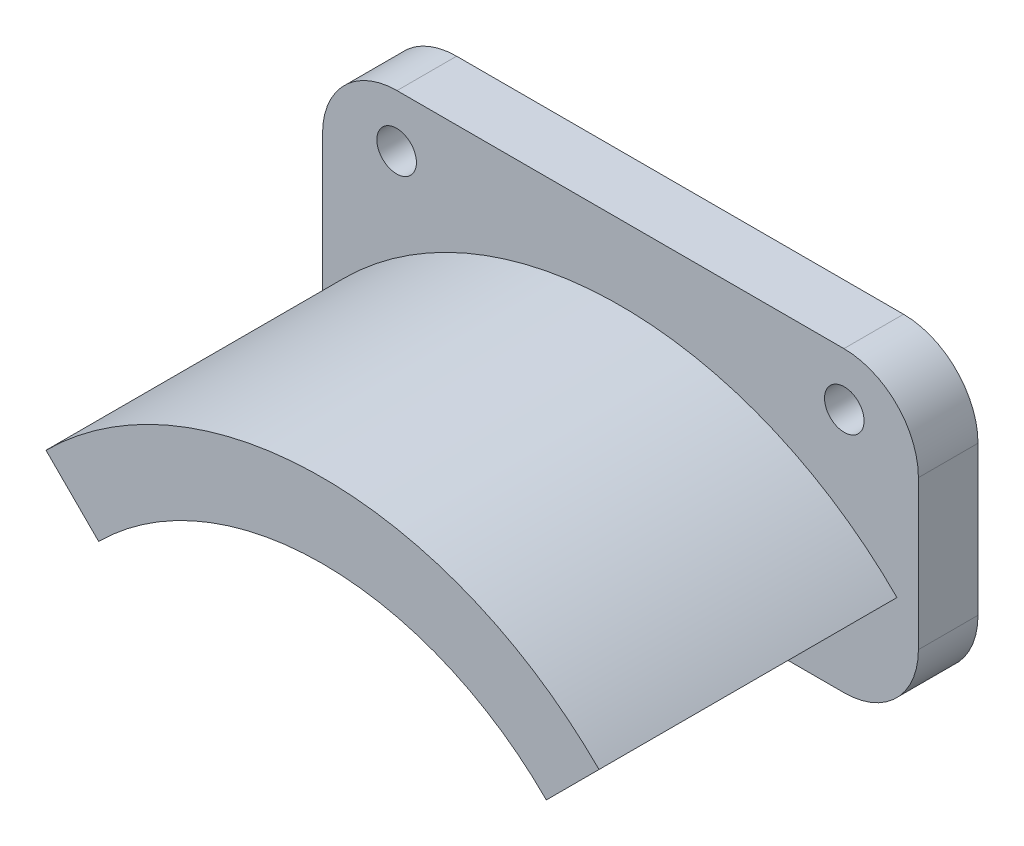
ISO-10303-21;
HEADER;
FILE_DESCRIPTION(('STEP AP214'),'2;1');
FILE_NAME('part.step','',(''),(''),'','','');
FILE_SCHEMA(('AUTOMOTIVE_DESIGN { 1 0 10303 214 1 1 1 1 }'));
ENDSEC;
DATA;
#1=APPLICATION_CONTEXT('core data for automotive mechanical design processes');
#2=APPLICATION_PROTOCOL_DEFINITION('international standard','automotive_design',2000,#1);
#3=PRODUCT_CONTEXT('',#1,'mechanical');
#4=PRODUCT('Part','Part','',(#3));
#5=PRODUCT_RELATED_PRODUCT_CATEGORY('part','',(#4));
#6=PRODUCT_DEFINITION_FORMATION('','',#4);
#7=PRODUCT_DEFINITION_CONTEXT('part definition',#1,'design');
#8=PRODUCT_DEFINITION('design','',#6,#7);
#9=PRODUCT_DEFINITION_SHAPE('','',#8);
#10=(LENGTH_UNIT() NAMED_UNIT(*) SI_UNIT(.MILLI.,.METRE.));
#11=(NAMED_UNIT(*) PLANE_ANGLE_UNIT() SI_UNIT($,.RADIAN.));
#12=(NAMED_UNIT(*) SI_UNIT($,.STERADIAN.) SOLID_ANGLE_UNIT());
#13=UNCERTAINTY_MEASURE_WITH_UNIT(LENGTH_MEASURE(1.E-05),#10,'distance_accuracy_value','');
#14=(GEOMETRIC_REPRESENTATION_CONTEXT(3) GLOBAL_UNCERTAINTY_ASSIGNED_CONTEXT((#13)) GLOBAL_UNIT_ASSIGNED_CONTEXT((#10,
#11,#12)) REPRESENTATION_CONTEXT('',''));
#15=CARTESIAN_POINT('',(0.,0.,0.));
#16=DIRECTION('',(0.,0.,1.));
#17=DIRECTION('',(1.,0.,0.));
#18=AXIS2_PLACEMENT_3D('',#15,#16,#17);
#19=CARTESIAN_POINT('',(0.,-21.25,-4.));
#20=DIRECTION('',(0.,0.,1.));
#21=DIRECTION('',(1.,0.,0.));
#22=AXIS2_PLACEMENT_3D('',#19,#20,#21);
#23=CYLINDRICAL_SURFACE('',#22,26.25);
#24=CARTESIAN_POINT('',(0.,-21.25,0.));
#25=DIRECTION('',(0.,0.,1.));
#26=DIRECTION('',(1.,0.,0.));
#27=AXIS2_PLACEMENT_3D('',#24,#25,#26);
#28=CIRCLE('',#27,26.25);
#29=CARTESIAN_POINT('',(18.5615530061468,-2.68844699385303,0.));
#30=VERTEX_POINT('',#29);
#31=CARTESIAN_POINT('',(-18.5615530061468,-2.68844699385304,0.));
#32=VERTEX_POINT('',#31);
#33=EDGE_CURVE('E190',#30,#32,#28,.T.);
#34=ORIENTED_EDGE('',*,*,#33,.T.);
#35=DIRECTION('',(0.,0.,1.));
#36=VECTOR('',#35,1.);
#37=CARTESIAN_POINT('',(-18.5615530061468,-2.68844699385304,-4.));
#38=LINE('',#37,#36);
#39=CARTESIAN_POINT('',(-18.5615530061468,-2.68844699385304,-4.));
#40=VERTEX_POINT('',#39);
#41=EDGE_CURVE('E165',#40,#32,#38,.T.);
#42=ORIENTED_EDGE('',*,*,#41,.F.);
#43=CARTESIAN_POINT('',(0.,-21.25,-4.));
#44=DIRECTION('',(0.,0.,1.));
#45=DIRECTION('',(1.,0.,0.));
#46=AXIS2_PLACEMENT_3D('',#43,#44,#45);
#47=CIRCLE('',#46,26.25);
#48=CARTESIAN_POINT('',(18.5615530061468,-2.68844699385303,-4.));
#49=VERTEX_POINT('',#48);
#50=EDGE_CURVE('E163',#49,#40,#47,.T.);
#51=ORIENTED_EDGE('',*,*,#50,.F.);
#52=DIRECTION('',(0.,0.,1.));
#53=VECTOR('',#52,1.);
#54=CARTESIAN_POINT('',(18.5615530061468,-2.68844699385303,-4.));
#55=LINE('',#54,#53);
#56=EDGE_CURVE('E148',#49,#30,#55,.T.);
#57=ORIENTED_EDGE('',*,*,#56,.T.);
#58=EDGE_LOOP('',(#34,#42,#51,#57));
#59=FACE_BOUND('',#58,.T.);
#60=ADVANCED_FACE('F55',(#59),#23,.F.);
#61=CARTESIAN_POINT('',(-10.625,-10.6249999999999,-4.));
#62=DIRECTION('',(-0.707106781186551,-0.707106781186544,0.));
#63=DIRECTION('',(0.707106781186544,-0.707106781186551,0.));
#64=AXIS2_PLACEMENT_3D('',#61,#62,#63);
#65=PLANE('',#64);
#66=DIRECTION('',(0.707106781186544,-0.707106781186551,0.));
#67=VECTOR('',#66,1.);
#68=CARTESIAN_POINT('',(-10.625,-10.6249999999999,0.));
#69=LINE('',#68,#67);
#70=CARTESIAN_POINT('',(-15.0260191002141,-6.22398089978579,0.));
#71=VERTEX_POINT('',#70);
#72=EDGE_CURVE('E196',#32,#71,#69,.T.);
#73=ORIENTED_EDGE('',*,*,#72,.T.);
#74=DIRECTION('',(0.,0.,1.));
#75=VECTOR('',#74,1.);
#76=CARTESIAN_POINT('',(-15.0260191002141,-6.22398089978579,-4.));
#77=LINE('',#76,#75);
#78=CARTESIAN_POINT('',(-15.0260191002141,-6.22398089978579,-4.));
#79=VERTEX_POINT('',#78);
#80=EDGE_CURVE('E202',#79,#71,#77,.T.);
#81=ORIENTED_EDGE('',*,*,#80,.F.);
#82=DIRECTION('',(0.707106781186544,-0.707106781186551,0.));
#83=VECTOR('',#82,1.);
#84=CARTESIAN_POINT('',(-10.625,-10.6249999999999,-4.));
#85=LINE('',#84,#83);
#86=EDGE_CURVE('E159',#40,#79,#85,.T.);
#87=ORIENTED_EDGE('',*,*,#86,.F.);
#88=ORIENTED_EDGE('',*,*,#41,.T.);
#89=EDGE_LOOP('',(#73,#81,#87,#88));
#90=FACE_BOUND('',#89,.T.);
#91=ADVANCED_FACE('F260',(#90),#65,.F.);
#92=CARTESIAN_POINT('',(0.,-21.25,-4.));
#93=DIRECTION('',(0.,0.,1.));
#94=DIRECTION('',(1.,0.,0.));
#95=AXIS2_PLACEMENT_3D('',#92,#93,#94);
#96=CYLINDRICAL_SURFACE('',#95,21.25);
#97=CARTESIAN_POINT('',(0.,-21.25,0.));
#98=DIRECTION('',(0.,0.,1.));
#99=DIRECTION('',(1.,0.,0.));
#100=AXIS2_PLACEMENT_3D('',#97,#98,#99);
#101=CIRCLE('',#100,21.25);
#102=CARTESIAN_POINT('',(15.0260191002141,-6.22398089978579,0.));
#103=VERTEX_POINT('',#102);
#104=EDGE_CURVE('E193',#103,#71,#101,.T.);
#105=ORIENTED_EDGE('',*,*,#104,.F.);
#106=DIRECTION('',(0.,0.,1.));
#107=VECTOR('',#106,1.);
#108=CARTESIAN_POINT('',(15.0260191002141,-6.22398089978579,-4.));
#109=LINE('',#108,#107);
#110=CARTESIAN_POINT('',(15.0260191002141,-6.22398089978579,-4.));
#111=VERTEX_POINT('',#110);
#112=EDGE_CURVE('E158',#111,#103,#109,.T.);
#113=ORIENTED_EDGE('',*,*,#112,.F.);
#114=CARTESIAN_POINT('',(0.,-21.25,-4.));
#115=DIRECTION('',(0.,0.,1.));
#116=DIRECTION('',(1.,0.,0.));
#117=AXIS2_PLACEMENT_3D('',#114,#115,#116);
#118=CIRCLE('',#117,21.25);
#119=EDGE_CURVE('E172',#111,#79,#118,.T.);
#120=ORIENTED_EDGE('',*,*,#119,.T.);
#121=ORIENTED_EDGE('',*,*,#80,.T.);
#122=EDGE_LOOP('',(#105,#113,#120,#121));
#123=FACE_BOUND('',#122,.T.);
#124=ADVANCED_FACE('F262',(#123),#96,.T.);
#125=CARTESIAN_POINT('',(-20.,0.,-4.));
#126=DIRECTION('',(-1.,0.,0.));
#127=DIRECTION('',(0.,0.,1.));
#128=AXIS2_PLACEMENT_3D('',#125,#126,#127);
#129=PLANE('',#128);
#130=DIRECTION('',(0.,-1.,0.));
#131=VECTOR('',#130,1.);
#132=CARTESIAN_POINT('',(-20.,0.,-4.));
#133=LINE('',#132,#131);
#134=CARTESIAN_POINT('',(-20.,4.99999999999999,-4.));
#135=VERTEX_POINT('',#134);
#136=CARTESIAN_POINT('',(-20.,-5.00000000000001,-4.));
#137=VERTEX_POINT('',#136);
#138=EDGE_CURVE('E199',#135,#137,#133,.T.);
#139=ORIENTED_EDGE('',*,*,#138,.T.);
#140=DIRECTION('',(0.,0.,1.));
#141=VECTOR('',#140,1.);
#142=CARTESIAN_POINT('',(-20.,-5.00000000000001,-4.));
#143=LINE('',#142,#141);
#144=CARTESIAN_POINT('',(-20.,-5.00000000000001,0.));
#145=VERTEX_POINT('',#144);
#146=EDGE_CURVE('E12',#137,#145,#143,.T.);
#147=ORIENTED_EDGE('',*,*,#146,.T.);
#148=DIRECTION('',(0.,-1.,0.));
#149=VECTOR('',#148,1.);
#150=CARTESIAN_POINT('',(-20.,0.,0.));
#151=LINE('',#150,#149);
#152=CARTESIAN_POINT('',(-20.,4.99999999999999,0.));
#153=VERTEX_POINT('',#152);
#154=EDGE_CURVE('E178',#153,#145,#151,.T.);
#155=ORIENTED_EDGE('',*,*,#154,.F.);
#156=DIRECTION('',(0.,0.,1.));
#157=VECTOR('',#156,1.);
#158=CARTESIAN_POINT('',(-20.,4.99999999999999,-4.));
#159=LINE('',#158,#157);
#160=EDGE_CURVE('E64',#153,#135,#159,.F.);
#161=ORIENTED_EDGE('',*,*,#160,.T.);
#162=EDGE_LOOP('',(#139,#147,#155,#161));
#163=FACE_BOUND('',#162,.T.);
#164=ADVANCED_FACE('F264',(#163),#129,.T.);
#165=CARTESIAN_POINT('',(0.,9.99999999999999,-4.));
#166=DIRECTION('',(0.,-1.,0.));
#167=DIRECTION('',(1.,0.,0.));
#168=AXIS2_PLACEMENT_3D('',#165,#166,#167);
#169=PLANE('',#168);
#170=DIRECTION('',(1.,0.,0.));
#171=VECTOR('',#170,1.);
#172=CARTESIAN_POINT('',(0.,9.99999999999999,0.));
#173=LINE('',#172,#171);
#174=CARTESIAN_POINT('',(-15.,9.99999999999999,0.));
#175=VERTEX_POINT('',#174);
#176=CARTESIAN_POINT('',(15.,9.99999999999999,0.));
#177=VERTEX_POINT('',#176);
#178=EDGE_CURVE('E187',#175,#177,#173,.T.);
#179=ORIENTED_EDGE('',*,*,#178,.T.);
#180=DIRECTION('',(0.,0.,1.));
#181=VECTOR('',#180,1.);
#182=CARTESIAN_POINT('',(15.,9.99999999999999,-4.));
#183=LINE('',#182,#181);
#184=CARTESIAN_POINT('',(15.,9.99999999999999,-4.));
#185=VERTEX_POINT('',#184);
#186=EDGE_CURVE('E220',#177,#185,#183,.F.);
#187=ORIENTED_EDGE('',*,*,#186,.T.);
#188=DIRECTION('',(1.,0.,0.));
#189=VECTOR('',#188,1.);
#190=CARTESIAN_POINT('',(0.,9.99999999999999,-4.));
#191=LINE('',#190,#189);
#192=CARTESIAN_POINT('',(-15.,9.99999999999999,-4.));
#193=VERTEX_POINT('',#192);
#194=EDGE_CURVE('E167',#193,#185,#191,.T.);
#195=ORIENTED_EDGE('',*,*,#194,.F.);
#196=DIRECTION('',(0.,0.,1.));
#197=VECTOR('',#196,1.);
#198=CARTESIAN_POINT('',(-15.,9.99999999999999,0.));
#199=LINE('',#198,#197);
#200=EDGE_CURVE('E217',#193,#175,#199,.T.);
#201=ORIENTED_EDGE('',*,*,#200,.T.);
#202=EDGE_LOOP('',(#179,#187,#195,#201));
#203=FACE_BOUND('',#202,.T.);
#204=ADVANCED_FACE('F271',(#203),#169,.F.);
#205=CARTESIAN_POINT('',(20.,0.,-4.));
#206=DIRECTION('',(-1.,0.,0.));
#207=DIRECTION('',(0.,-1.,0.));
#208=AXIS2_PLACEMENT_3D('',#205,#206,#207);
#209=PLANE('',#208);
#210=DIRECTION('',(0.,-1.,0.));
#211=VECTOR('',#210,1.);
#212=CARTESIAN_POINT('',(20.,0.,-4.));
#213=LINE('',#212,#211);
#214=CARTESIAN_POINT('',(20.,4.99999999999999,-4.));
#215=VERTEX_POINT('',#214);
#216=CARTESIAN_POINT('',(20.,-5.,-4.));
#217=VERTEX_POINT('',#216);
#218=EDGE_CURVE('E315',#215,#217,#213,.T.);
#219=ORIENTED_EDGE('',*,*,#218,.F.);
#220=DIRECTION('',(0.,0.,1.));
#221=VECTOR('',#220,1.);
#222=CARTESIAN_POINT('',(20.,4.99999999999999,-4.));
#223=LINE('',#222,#221);
#224=CARTESIAN_POINT('',(20.,4.99999999999999,0.));
#225=VERTEX_POINT('',#224);
#226=EDGE_CURVE('E206',#215,#225,#223,.T.);
#227=ORIENTED_EDGE('',*,*,#226,.T.);
#228=DIRECTION('',(0.,-1.,0.));
#229=VECTOR('',#228,1.);
#230=CARTESIAN_POINT('',(20.,0.,0.));
#231=LINE('',#230,#229);
#232=CARTESIAN_POINT('',(20.,-5.,0.));
#233=VERTEX_POINT('',#232);
#234=EDGE_CURVE('E184',#225,#233,#231,.T.);
#235=ORIENTED_EDGE('',*,*,#234,.T.);
#236=DIRECTION('',(0.,0.,1.));
#237=VECTOR('',#236,1.);
#238=CARTESIAN_POINT('',(20.,-5.,-4.));
#239=LINE('',#238,#237);
#240=EDGE_CURVE('E201',#233,#217,#239,.F.);
#241=ORIENTED_EDGE('',*,*,#240,.T.);
#242=EDGE_LOOP('',(#219,#227,#235,#241));
#243=FACE_BOUND('',#242,.T.);
#244=ADVANCED_FACE('F283',(#243),#209,.F.);
#245=CARTESIAN_POINT('',(0.,-10.,-4.));
#246=DIRECTION('',(0.,-1.,0.));
#247=DIRECTION('',(0.,0.,-1.));
#248=AXIS2_PLACEMENT_3D('',#245,#246,#247);
#249=PLANE('',#248);
#250=DIRECTION('',(1.,0.,0.));
#251=VECTOR('',#250,1.);
#252=CARTESIAN_POINT('',(0.,-10.,-4.));
#253=LINE('',#252,#251);
#254=CARTESIAN_POINT('',(-15.,-10.,-4.));
#255=VERTEX_POINT('',#254);
#256=CARTESIAN_POINT('',(15.,-10.,-4.));
#257=VERTEX_POINT('',#256);
#258=EDGE_CURVE('E311',#255,#257,#253,.T.);
#259=ORIENTED_EDGE('',*,*,#258,.T.);
#260=DIRECTION('',(0.,0.,1.));
#261=VECTOR('',#260,1.);
#262=CARTESIAN_POINT('',(15.,-10.,0.));
#263=LINE('',#262,#261);
#264=CARTESIAN_POINT('',(15.,-10.,0.));
#265=VERTEX_POINT('',#264);
#266=EDGE_CURVE('E230',#257,#265,#263,.T.);
#267=ORIENTED_EDGE('',*,*,#266,.T.);
#268=DIRECTION('',(1.,0.,0.));
#269=VECTOR('',#268,1.);
#270=CARTESIAN_POINT('',(0.,-10.,0.));
#271=LINE('',#270,#269);
#272=CARTESIAN_POINT('',(-15.,-10.,0.));
#273=VERTEX_POINT('',#272);
#274=EDGE_CURVE('E181',#273,#265,#271,.T.);
#275=ORIENTED_EDGE('',*,*,#274,.F.);
#276=DIRECTION('',(0.,0.,1.));
#277=VECTOR('',#276,1.);
#278=CARTESIAN_POINT('',(-15.,-10.,-4.));
#279=LINE('',#278,#277);
#280=EDGE_CURVE('E79',#273,#255,#279,.F.);
#281=ORIENTED_EDGE('',*,*,#280,.T.);
#282=EDGE_LOOP('',(#259,#267,#275,#281));
#283=FACE_BOUND('',#282,.T.);
#284=ADVANCED_FACE('F287',(#283),#249,.T.);
#285=CARTESIAN_POINT('',(10.625,-10.6249999999999,-4.));
#286=DIRECTION('',(-0.707106781186552,0.707106781186543,0.));
#287=DIRECTION('',(-0.707106781186543,-0.707106781186552,0.));
#288=AXIS2_PLACEMENT_3D('',#285,#286,#287);
#289=PLANE('',#288);
#290=DIRECTION('',(-0.707106781186543,-0.707106781186552,0.));
#291=VECTOR('',#290,1.);
#292=CARTESIAN_POINT('',(10.625,-10.6249999999999,0.));
#293=LINE('',#292,#291);
#294=EDGE_CURVE('E154',#30,#103,#293,.T.);
#295=ORIENTED_EDGE('',*,*,#294,.F.);
#296=ORIENTED_EDGE('',*,*,#56,.F.);
#297=DIRECTION('',(-0.707106781186543,-0.707106781186552,0.));
#298=VECTOR('',#297,1.);
#299=CARTESIAN_POINT('',(10.625,-10.6249999999999,-4.));
#300=LINE('',#299,#298);
#301=EDGE_CURVE('E152',#49,#111,#300,.T.);
#302=ORIENTED_EDGE('',*,*,#301,.T.);
#303=ORIENTED_EDGE('',*,*,#112,.T.);
#304=EDGE_LOOP('',(#295,#296,#302,#303));
#305=FACE_BOUND('',#304,.T.);
#306=ADVANCED_FACE('F150',(#305),#289,.T.);
#307=CARTESIAN_POINT('',(0.,0.,-4.));
#308=DIRECTION('',(0.,0.,1.));
#309=DIRECTION('',(1.,0.,0.));
#310=AXIS2_PLACEMENT_3D('',#307,#308,#309);
#311=PLANE('',#310);
#312=CARTESIAN_POINT('',(15.0246234134034,6.46885921792367,-4.));
#313=DIRECTION('',(0.,0.,1.));
#314=DIRECTION('',(1.,0.,0.));
#315=AXIS2_PLACEMENT_3D('',#312,#313,#314);
#316=CIRCLE('',#315,1.32715731225997);
#317=CARTESIAN_POINT('',(16.3517807256634,6.46885921792367,-4.));
#318=VERTEX_POINT('',#317);
#319=EDGE_CURVE('E237',#318,#318,#316,.T.);
#320=ORIENTED_EDGE('',*,*,#319,.T.);
#321=EDGE_LOOP('',(#320));
#322=FACE_BOUND('',#321,.T.);
#323=CARTESIAN_POINT('',(0.,-6.03114078207633,-4.));
#324=DIRECTION('',(0.,0.,1.));
#325=DIRECTION('',(1.,0.,0.));
#326=AXIS2_PLACEMENT_3D('',#323,#324,#325);
#327=CIRCLE('',#326,1.25);
#328=CARTESIAN_POINT('',(1.25,-6.03114078207633,-4.));
#329=VERTEX_POINT('',#328);
#330=EDGE_CURVE('E331',#329,#329,#327,.T.);
#331=ORIENTED_EDGE('',*,*,#330,.T.);
#332=EDGE_LOOP('',(#331));
#333=FACE_BOUND('',#332,.T.);
#334=CARTESIAN_POINT('',(-15.0246234134034,6.46885921792366,-4.));
#335=DIRECTION('',(0.,0.,1.));
#336=DIRECTION('',(-1.,0.,0.));
#337=AXIS2_PLACEMENT_3D('',#334,#335,#336);
#338=CIRCLE('',#337,1.32715731225997);
#339=CARTESIAN_POINT('',(-16.3517807256634,6.46885921792366,-4.));
#340=VERTEX_POINT('',#339);
#341=EDGE_CURVE('E318',#340,#340,#338,.T.);
#342=ORIENTED_EDGE('',*,*,#341,.T.);
#343=EDGE_LOOP('',(#342));
#344=FACE_BOUND('',#343,.T.);
#345=ORIENTED_EDGE('',*,*,#194,.T.);
#346=CARTESIAN_POINT('',(15.,4.99999999999999,-4.));
#347=DIRECTION('',(0.,0.,1.));
#348=DIRECTION('',(1.,0.,0.));
#349=AXIS2_PLACEMENT_3D('',#346,#347,#348);
#350=CIRCLE('',#349,5.);
#351=EDGE_CURVE('E227',#185,#215,#350,.F.);
#352=ORIENTED_EDGE('',*,*,#351,.T.);
#353=ORIENTED_EDGE('',*,*,#218,.T.);
#354=CARTESIAN_POINT('',(15.,-5.00000000000001,-4.));
#355=DIRECTION('',(0.,0.,1.));
#356=DIRECTION('',(1.,0.,0.));
#357=AXIS2_PLACEMENT_3D('',#354,#355,#356);
#358=CIRCLE('',#357,5.);
#359=EDGE_CURVE('E72',#217,#257,#358,.F.);
#360=ORIENTED_EDGE('',*,*,#359,.T.);
#361=ORIENTED_EDGE('',*,*,#258,.F.);
#362=CARTESIAN_POINT('',(-15.,-5.00000000000001,-4.));
#363=DIRECTION('',(0.,0.,1.));
#364=DIRECTION('',(1.,0.,0.));
#365=AXIS2_PLACEMENT_3D('',#362,#363,#364);
#366=CIRCLE('',#365,5.);
#367=EDGE_CURVE('E224',#255,#137,#366,.F.);
#368=ORIENTED_EDGE('',*,*,#367,.T.);
#369=ORIENTED_EDGE('',*,*,#138,.F.);
#370=CARTESIAN_POINT('',(-15.,4.99999999999999,-4.));
#371=DIRECTION('',(0.,0.,1.));
#372=DIRECTION('',(1.,0.,0.));
#373=AXIS2_PLACEMENT_3D('',#370,#371,#372);
#374=CIRCLE('',#373,5.);
#375=EDGE_CURVE('E222',#135,#193,#374,.F.);
#376=ORIENTED_EDGE('',*,*,#375,.T.);
#377=EDGE_LOOP('',(#345,#352,#353,#360,#361,#368,#369,#376));
#378=FACE_BOUND('',#377,.T.);
#379=ORIENTED_EDGE('',*,*,#50,.T.);
#380=ORIENTED_EDGE('',*,*,#86,.T.);
#381=ORIENTED_EDGE('',*,*,#119,.F.);
#382=ORIENTED_EDGE('',*,*,#301,.F.);
#383=EDGE_LOOP('',(#379,#380,#381,#382));
#384=FACE_BOUND('',#383,.T.);
#385=ADVANCED_FACE('F170',(#322,#333,#344,#378,#384),#311,.F.);
#386=CARTESIAN_POINT('',(0.,0.,0.));
#387=DIRECTION('',(0.,0.,1.));
#388=DIRECTION('',(1.,0.,0.));
#389=AXIS2_PLACEMENT_3D('',#386,#387,#388);
#390=PLANE('',#389);
#391=CARTESIAN_POINT('',(15.0246234134034,6.46885921792367,0.));
#392=DIRECTION('',(0.,0.,1.));
#393=DIRECTION('',(1.,0.,0.));
#394=AXIS2_PLACEMENT_3D('',#391,#392,#393);
#395=CIRCLE('',#394,1.32715731225997);
#396=CARTESIAN_POINT('',(16.3517807256634,6.46885921792367,0.));
#397=VERTEX_POINT('',#396);
#398=EDGE_CURVE('E59',#397,#397,#395,.T.);
#399=ORIENTED_EDGE('',*,*,#398,.F.);
#400=EDGE_LOOP('',(#399));
#401=FACE_BOUND('',#400,.T.);
#402=CARTESIAN_POINT('',(0.,-6.03114078207633,0.));
#403=DIRECTION('',(0.,0.,1.));
#404=DIRECTION('',(1.,0.,0.));
#405=AXIS2_PLACEMENT_3D('',#402,#403,#404);
#406=CIRCLE('',#405,1.25);
#407=CARTESIAN_POINT('',(1.25,-6.03114078207633,0.));
#408=VERTEX_POINT('',#407);
#409=EDGE_CURVE('E236',#408,#408,#406,.T.);
#410=ORIENTED_EDGE('',*,*,#409,.F.);
#411=EDGE_LOOP('',(#410));
#412=FACE_BOUND('',#411,.T.);
#413=CARTESIAN_POINT('',(-15.0246234134034,6.46885921792366,0.));
#414=DIRECTION('',(0.,0.,1.));
#415=DIRECTION('',(1.,0.,0.));
#416=AXIS2_PLACEMENT_3D('',#413,#414,#415);
#417=CIRCLE('',#416,1.32715731225997);
#418=CARTESIAN_POINT('',(-13.6974661011434,6.46885921792366,0.));
#419=VERTEX_POINT('',#418);
#420=EDGE_CURVE('E234',#419,#419,#417,.T.);
#421=ORIENTED_EDGE('',*,*,#420,.F.);
#422=EDGE_LOOP('',(#421));
#423=FACE_BOUND('',#422,.T.);
#424=ORIENTED_EDGE('',*,*,#234,.F.);
#425=CARTESIAN_POINT('',(15.,4.99999999999999,0.));
#426=DIRECTION('',(0.,0.,1.));
#427=DIRECTION('',(1.,0.,0.));
#428=AXIS2_PLACEMENT_3D('',#425,#426,#427);
#429=CIRCLE('',#428,5.);
#430=EDGE_CURVE('E215',#225,#177,#429,.T.);
#431=ORIENTED_EDGE('',*,*,#430,.T.);
#432=ORIENTED_EDGE('',*,*,#178,.F.);
#433=CARTESIAN_POINT('',(-15.,4.99999999999999,0.));
#434=DIRECTION('',(0.,0.,1.));
#435=DIRECTION('',(1.,0.,0.));
#436=AXIS2_PLACEMENT_3D('',#433,#434,#435);
#437=CIRCLE('',#436,5.);
#438=EDGE_CURVE('E209',#175,#153,#437,.T.);
#439=ORIENTED_EDGE('',*,*,#438,.T.);
#440=ORIENTED_EDGE('',*,*,#154,.T.);
#441=CARTESIAN_POINT('',(-15.,-5.00000000000001,0.));
#442=DIRECTION('',(0.,0.,1.));
#443=DIRECTION('',(1.,0.,0.));
#444=AXIS2_PLACEMENT_3D('',#441,#442,#443);
#445=CIRCLE('',#444,5.);
#446=EDGE_CURVE('E211',#145,#273,#445,.T.);
#447=ORIENTED_EDGE('',*,*,#446,.T.);
#448=ORIENTED_EDGE('',*,*,#274,.T.);
#449=CARTESIAN_POINT('',(15.,-5.00000000000001,0.));
#450=DIRECTION('',(0.,0.,1.));
#451=DIRECTION('',(1.,0.,0.));
#452=AXIS2_PLACEMENT_3D('',#449,#450,#451);
#453=CIRCLE('',#452,5.);
#454=EDGE_CURVE('E213',#265,#233,#453,.T.);
#455=ORIENTED_EDGE('',*,*,#454,.T.);
#456=EDGE_LOOP('',(#424,#431,#432,#439,#440,#447,#448,#455));
#457=FACE_BOUND('',#456,.T.);
#458=ORIENTED_EDGE('',*,*,#33,.F.);
#459=ORIENTED_EDGE('',*,*,#294,.T.);
#460=ORIENTED_EDGE('',*,*,#104,.T.);
#461=ORIENTED_EDGE('',*,*,#72,.F.);
#462=EDGE_LOOP('',(#458,#459,#460,#461));
#463=FACE_BOUND('',#462,.T.);
#464=ADVANCED_FACE('F247',(#401,#412,#423,#457,#463),#390,.T.);
#465=CARTESIAN_POINT('',(15.,4.99999999999999,-4.));
#466=DIRECTION('',(0.,0.,1.));
#467=DIRECTION('',(1.,0.,0.));
#468=AXIS2_PLACEMENT_3D('',#465,#466,#467);
#469=CYLINDRICAL_SURFACE('',#468,5.);
#470=ORIENTED_EDGE('',*,*,#351,.F.);
#471=ORIENTED_EDGE('',*,*,#186,.F.);
#472=ORIENTED_EDGE('',*,*,#430,.F.);
#473=ORIENTED_EDGE('',*,*,#226,.F.);
#474=EDGE_LOOP('',(#470,#471,#472,#473));
#475=FACE_BOUND('',#474,.T.);
#476=ADVANCED_FACE('F250',(#475),#469,.T.);
#477=CARTESIAN_POINT('',(15.,-5.00000000000001,-4.));
#478=DIRECTION('',(0.,0.,-1.));
#479=DIRECTION('',(-1.,0.,0.));
#480=AXIS2_PLACEMENT_3D('',#477,#478,#479);
#481=CYLINDRICAL_SURFACE('',#480,5.);
#482=ORIENTED_EDGE('',*,*,#359,.F.);
#483=ORIENTED_EDGE('',*,*,#240,.F.);
#484=ORIENTED_EDGE('',*,*,#454,.F.);
#485=ORIENTED_EDGE('',*,*,#266,.F.);
#486=EDGE_LOOP('',(#482,#483,#484,#485));
#487=FACE_BOUND('',#486,.T.);
#488=ADVANCED_FACE('F293',(#487),#481,.T.);
#489=CARTESIAN_POINT('',(-15.,-5.00000000000001,-4.));
#490=DIRECTION('',(0.,0.,1.));
#491=DIRECTION('',(1.,0.,0.));
#492=AXIS2_PLACEMENT_3D('',#489,#490,#491);
#493=CYLINDRICAL_SURFACE('',#492,5.);
#494=ORIENTED_EDGE('',*,*,#367,.F.);
#495=ORIENTED_EDGE('',*,*,#280,.F.);
#496=ORIENTED_EDGE('',*,*,#446,.F.);
#497=ORIENTED_EDGE('',*,*,#146,.F.);
#498=EDGE_LOOP('',(#494,#495,#496,#497));
#499=FACE_BOUND('',#498,.T.);
#500=ADVANCED_FACE('F296',(#499),#493,.T.);
#501=CARTESIAN_POINT('',(-15.,4.99999999999999,-4.));
#502=DIRECTION('',(0.,0.,-1.));
#503=DIRECTION('',(-1.,0.,0.));
#504=AXIS2_PLACEMENT_3D('',#501,#502,#503);
#505=CYLINDRICAL_SURFACE('',#504,5.);
#506=ORIENTED_EDGE('',*,*,#375,.F.);
#507=ORIENTED_EDGE('',*,*,#160,.F.);
#508=ORIENTED_EDGE('',*,*,#438,.F.);
#509=ORIENTED_EDGE('',*,*,#200,.F.);
#510=EDGE_LOOP('',(#506,#507,#508,#509));
#511=FACE_BOUND('',#510,.T.);
#512=ADVANCED_FACE('F57',(#511),#505,.T.);
#513=CARTESIAN_POINT('',(-15.0246234134034,6.46885921792366,-4.));
#514=DIRECTION('',(0.,0.,1.));
#515=DIRECTION('',(1.,0.,0.));
#516=AXIS2_PLACEMENT_3D('',#513,#514,#515);
#517=CYLINDRICAL_SURFACE('',#516,1.32715731225997);
#518=ORIENTED_EDGE('',*,*,#420,.T.);
#519=EDGE_LOOP('',(#518));
#520=FACE_BOUND('',#519,.T.);
#521=ORIENTED_EDGE('',*,*,#341,.F.);
#522=EDGE_LOOP('',(#521));
#523=FACE_BOUND('',#522,.T.);
#524=ADVANCED_FACE('F303',(#520,#523),#517,.F.);
#525=CARTESIAN_POINT('',(0.,-6.03114078207633,-4.));
#526=DIRECTION('',(0.,0.,1.));
#527=DIRECTION('',(1.,0.,0.));
#528=AXIS2_PLACEMENT_3D('',#525,#526,#527);
#529=CYLINDRICAL_SURFACE('',#528,1.25);
#530=ORIENTED_EDGE('',*,*,#409,.T.);
#531=EDGE_LOOP('',(#530));
#532=FACE_BOUND('',#531,.T.);
#533=ORIENTED_EDGE('',*,*,#330,.F.);
#534=EDGE_LOOP('',(#533));
#535=FACE_BOUND('',#534,.T.);
#536=ADVANCED_FACE('F339',(#532,#535),#529,.F.);
#537=CARTESIAN_POINT('',(15.0246234134034,6.46885921792367,-4.));
#538=DIRECTION('',(0.,0.,1.));
#539=DIRECTION('',(1.,0.,0.));
#540=AXIS2_PLACEMENT_3D('',#537,#538,#539);
#541=CYLINDRICAL_SURFACE('',#540,1.32715731225997);
#542=ORIENTED_EDGE('',*,*,#398,.T.);
#543=EDGE_LOOP('',(#542));
#544=FACE_BOUND('',#543,.T.);
#545=ORIENTED_EDGE('',*,*,#319,.F.);
#546=EDGE_LOOP('',(#545));
#547=FACE_BOUND('',#546,.T.);
#548=ADVANCED_FACE('F244',(#544,#547),#541,.F.);
#549=CLOSED_SHELL('',(#60,#91,#124,#164,#204,#244,#284,#306,#385,#464,#476,#488,#500,#512,#524,
#536,#548));
#550=MANIFOLD_SOLID_BREP('B2',#549);
#551=CARTESIAN_POINT('',(10.625,-10.6249999999999,20.));
#552=DIRECTION('',(0.707106781186552,-0.707106781186543,0.));
#553=DIRECTION('',(0.707106781186543,0.707106781186552,0.));
#554=AXIS2_PLACEMENT_3D('',#551,#552,#553);
#555=PLANE('',#554);
#556=DIRECTION('',(-0.707106781186543,-0.707106781186552,0.));
#557=VECTOR('',#556,1.);
#558=CARTESIAN_POINT('',(10.625,-10.6249999999999,0.));
#559=LINE('',#558,#557);
#560=CARTESIAN_POINT('',(18.5615530061468,-2.68844699385303,0.));
#561=VERTEX_POINT('',#560);
#562=CARTESIAN_POINT('',(15.0260191002141,-6.22398089978579,0.));
#563=VERTEX_POINT('',#562);
#564=EDGE_CURVE('E538',#561,#563,#559,.T.);
#565=ORIENTED_EDGE('',*,*,#564,.F.);
#566=DIRECTION('',(0.,0.,-1.));
#567=VECTOR('',#566,1.);
#568=CARTESIAN_POINT('',(18.5615530061468,-2.68844699385303,20.));
#569=LINE('',#568,#567);
#570=CARTESIAN_POINT('',(18.5615530061468,-2.68844699385303,20.));
#571=VERTEX_POINT('',#570);
#572=EDGE_CURVE('E53',#571,#561,#569,.T.);
#573=ORIENTED_EDGE('',*,*,#572,.F.);
#574=DIRECTION('',(-0.707106781186543,-0.707106781186552,0.));
#575=VECTOR('',#574,1.);
#576=CARTESIAN_POINT('',(10.625,-10.6249999999999,20.));
#577=LINE('',#576,#575);
#578=CARTESIAN_POINT('',(15.0260191002141,-6.22398089978579,20.));
#579=VERTEX_POINT('',#578);
#580=EDGE_CURVE('E519',#571,#579,#577,.T.);
#581=ORIENTED_EDGE('',*,*,#580,.T.);
#582=DIRECTION('',(0.,0.,-1.));
#583=VECTOR('',#582,1.);
#584=CARTESIAN_POINT('',(15.0260191002141,-6.22398089978579,20.));
#585=LINE('',#584,#583);
#586=EDGE_CURVE('E487',#579,#563,#585,.T.);
#587=ORIENTED_EDGE('',*,*,#586,.T.);
#588=EDGE_LOOP('',(#565,#573,#581,#587));
#589=FACE_BOUND('',#588,.T.);
#590=ADVANCED_FACE('F470',(#589),#555,.T.);
#591=CARTESIAN_POINT('',(0.,-21.25,20.));
#592=DIRECTION('',(0.,0.,-1.));
#593=DIRECTION('',(-1.,0.,0.));
#594=AXIS2_PLACEMENT_3D('',#591,#592,#593);
#595=CYLINDRICAL_SURFACE('',#594,26.25);
#596=CARTESIAN_POINT('',(0.,-21.25,0.));
#597=DIRECTION('',(0.,0.,1.));
#598=DIRECTION('',(1.,0.,0.));
#599=AXIS2_PLACEMENT_3D('',#596,#597,#598);
#600=CIRCLE('',#599,26.25);
#601=CARTESIAN_POINT('',(-18.5615530061468,-2.68844699385304,0.));
#602=VERTEX_POINT('',#601);
#603=EDGE_CURVE('E526',#561,#602,#600,.T.);
#604=ORIENTED_EDGE('',*,*,#603,.T.);
#605=DIRECTION('',(0.,0.,-1.));
#606=VECTOR('',#605,1.);
#607=CARTESIAN_POINT('',(-18.5615530061468,-2.68844699385304,20.));
#608=LINE('',#607,#606);
#609=CARTESIAN_POINT('',(-18.5615530061468,-2.68844699385304,20.));
#610=VERTEX_POINT('',#609);
#611=EDGE_CURVE('E479',#610,#602,#608,.T.);
#612=ORIENTED_EDGE('',*,*,#611,.F.);
#613=CARTESIAN_POINT('',(0.,-21.25,20.));
#614=DIRECTION('',(0.,0.,1.));
#615=DIRECTION('',(1.,0.,0.));
#616=AXIS2_PLACEMENT_3D('',#613,#614,#615);
#617=CIRCLE('',#616,26.25);
#618=EDGE_CURVE('E513',#571,#610,#617,.T.);
#619=ORIENTED_EDGE('',*,*,#618,.F.);
#620=ORIENTED_EDGE('',*,*,#572,.T.);
#621=EDGE_LOOP('',(#604,#612,#619,#620));
#622=FACE_BOUND('',#621,.T.);
#623=ADVANCED_FACE('F524',(#622),#595,.T.);
#624=CARTESIAN_POINT('',(-10.625,-10.6249999999999,20.));
#625=DIRECTION('',(0.707106781186551,0.707106781186544,0.));
#626=DIRECTION('',(-0.707106781186544,0.707106781186551,0.));
#627=AXIS2_PLACEMENT_3D('',#624,#625,#626);
#628=PLANE('',#627);
#629=DIRECTION('',(0.707106781186544,-0.707106781186551,0.));
#630=VECTOR('',#629,1.);
#631=CARTESIAN_POINT('',(-10.625,-10.6249999999999,0.));
#632=LINE('',#631,#630);
#633=CARTESIAN_POINT('',(-15.0260191002141,-6.22398089978579,0.));
#634=VERTEX_POINT('',#633);
#635=EDGE_CURVE('E543',#602,#634,#632,.T.);
#636=ORIENTED_EDGE('',*,*,#635,.T.);
#637=DIRECTION('',(0.,0.,-1.));
#638=VECTOR('',#637,1.);
#639=CARTESIAN_POINT('',(-15.0260191002141,-6.22398089978579,20.));
#640=LINE('',#639,#638);
#641=CARTESIAN_POINT('',(-15.0260191002141,-6.22398089978579,20.));
#642=VERTEX_POINT('',#641);
#643=EDGE_CURVE('E501',#642,#634,#640,.T.);
#644=ORIENTED_EDGE('',*,*,#643,.F.);
#645=DIRECTION('',(0.707106781186544,-0.707106781186551,0.));
#646=VECTOR('',#645,1.);
#647=CARTESIAN_POINT('',(-10.625,-10.6249999999999,20.));
#648=LINE('',#647,#646);
#649=EDGE_CURVE('E518',#610,#642,#648,.T.);
#650=ORIENTED_EDGE('',*,*,#649,.F.);
#651=ORIENTED_EDGE('',*,*,#611,.T.);
#652=EDGE_LOOP('',(#636,#644,#650,#651));
#653=FACE_BOUND('',#652,.T.);
#654=ADVANCED_FACE('F530',(#653),#628,.F.);
#655=CARTESIAN_POINT('',(0.,-21.25,20.));
#656=DIRECTION('',(0.,0.,-1.));
#657=DIRECTION('',(-1.,0.,0.));
#658=AXIS2_PLACEMENT_3D('',#655,#656,#657);
#659=CYLINDRICAL_SURFACE('',#658,21.25);
#660=CARTESIAN_POINT('',(0.,-21.25,0.));
#661=DIRECTION('',(0.,0.,1.));
#662=DIRECTION('',(1.,0.,0.));
#663=AXIS2_PLACEMENT_3D('',#660,#661,#662);
#664=CIRCLE('',#663,21.25);
#665=EDGE_CURVE('E546',#563,#634,#664,.T.);
#666=ORIENTED_EDGE('',*,*,#665,.F.);
#667=ORIENTED_EDGE('',*,*,#586,.F.);
#668=CARTESIAN_POINT('',(0.,-21.25,20.));
#669=DIRECTION('',(0.,0.,1.));
#670=DIRECTION('',(1.,0.,0.));
#671=AXIS2_PLACEMENT_3D('',#668,#669,#670);
#672=CIRCLE('',#671,21.25);
#673=EDGE_CURVE('E532',#579,#642,#672,.T.);
#674=ORIENTED_EDGE('',*,*,#673,.T.);
#675=ORIENTED_EDGE('',*,*,#643,.T.);
#676=EDGE_LOOP('',(#666,#667,#674,#675));
#677=FACE_BOUND('',#676,.T.);
#678=ADVANCED_FACE('F555',(#677),#659,.F.);
#679=CARTESIAN_POINT('',(0.,0.,20.));
#680=DIRECTION('',(0.,0.,1.));
#681=DIRECTION('',(1.,0.,0.));
#682=AXIS2_PLACEMENT_3D('',#679,#680,#681);
#683=PLANE('',#682);
#684=ORIENTED_EDGE('',*,*,#580,.F.);
#685=ORIENTED_EDGE('',*,*,#618,.T.);
#686=ORIENTED_EDGE('',*,*,#649,.T.);
#687=ORIENTED_EDGE('',*,*,#673,.F.);
#688=EDGE_LOOP('',(#684,#685,#686,#687));
#689=FACE_BOUND('',#688,.T.);
#690=ADVANCED_FACE('F515',(#689),#683,.T.);
#691=CARTESIAN_POINT('',(0.,0.,0.));
#692=DIRECTION('',(0.,0.,1.));
#693=DIRECTION('',(1.,0.,0.));
#694=AXIS2_PLACEMENT_3D('',#691,#692,#693);
#695=PLANE('',#694);
#696=ORIENTED_EDGE('',*,*,#564,.T.);
#697=ORIENTED_EDGE('',*,*,#665,.T.);
#698=ORIENTED_EDGE('',*,*,#635,.F.);
#699=ORIENTED_EDGE('',*,*,#603,.F.);
#700=EDGE_LOOP('',(#696,#697,#698,#699));
#701=FACE_BOUND('',#700,.T.);
#702=ADVANCED_FACE('F562',(#701),#695,.F.);
#703=CLOSED_SHELL('',(#590,#623,#654,#678,#690,#702));
#704=MANIFOLD_SOLID_BREP('B6',#703);
#705=ADVANCED_BREP_SHAPE_REPRESENTATION('',(#18,#550,#704),#14);
#706=SHAPE_DEFINITION_REPRESENTATION(#9,#705);
ENDSEC;
END-ISO-10303-21;
